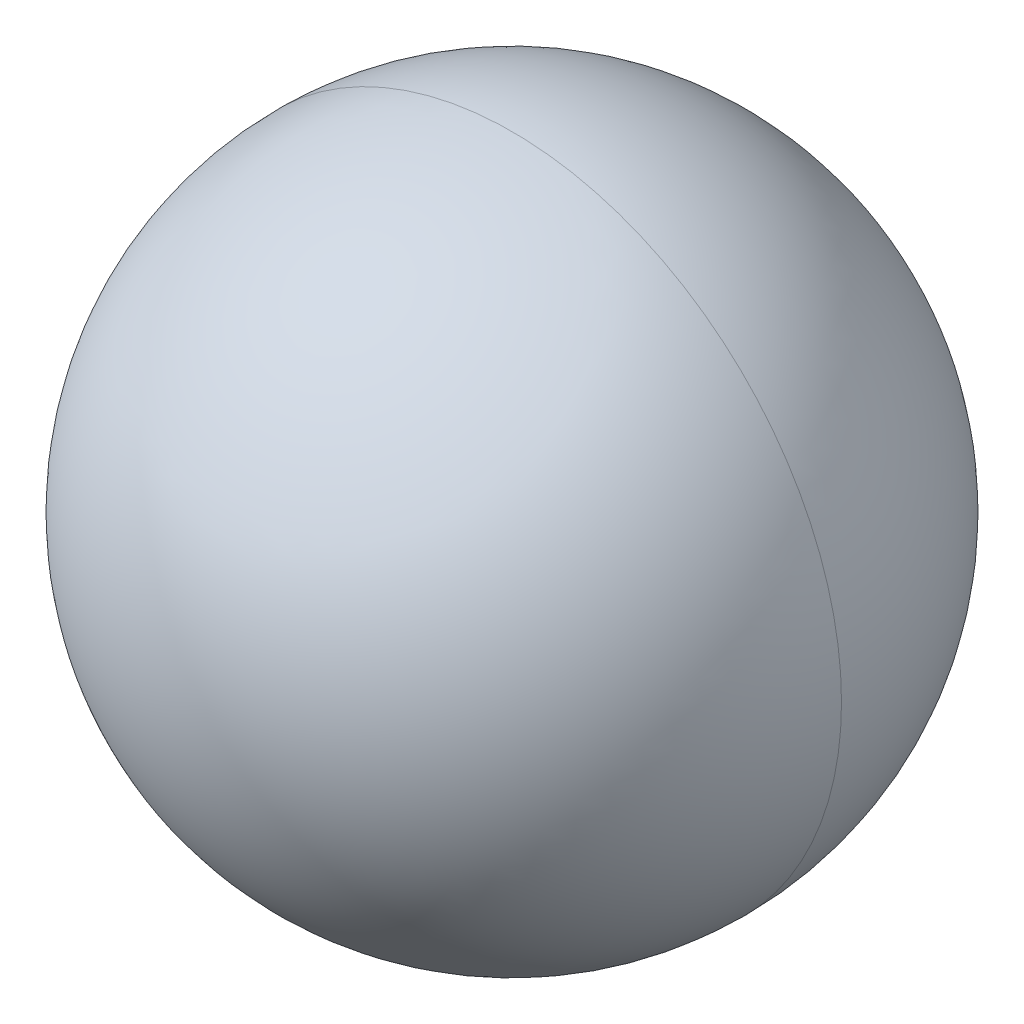
ISO-10303-21;
HEADER;
FILE_DESCRIPTION(('STEP AP214'),'2;1');
FILE_NAME('part.step','',(''),(''),'','','');
FILE_SCHEMA(('AUTOMOTIVE_DESIGN { 1 0 10303 214 1 1 1 1 }'));
ENDSEC;
DATA;
#1=APPLICATION_CONTEXT('core data for automotive mechanical design processes');
#2=APPLICATION_PROTOCOL_DEFINITION('international standard','automotive_design',2000,#1);
#3=PRODUCT_CONTEXT('',#1,'mechanical');
#4=PRODUCT('Part','Part','',(#3));
#5=PRODUCT_RELATED_PRODUCT_CATEGORY('part','',(#4));
#6=PRODUCT_DEFINITION_FORMATION('','',#4);
#7=PRODUCT_DEFINITION_CONTEXT('part definition',#1,'design');
#8=PRODUCT_DEFINITION('design','',#6,#7);
#9=PRODUCT_DEFINITION_SHAPE('','',#8);
#10=(LENGTH_UNIT() NAMED_UNIT(*) SI_UNIT(.MILLI.,.METRE.));
#11=(NAMED_UNIT(*) PLANE_ANGLE_UNIT() SI_UNIT($,.RADIAN.));
#12=(NAMED_UNIT(*) SI_UNIT($,.STERADIAN.) SOLID_ANGLE_UNIT());
#13=UNCERTAINTY_MEASURE_WITH_UNIT(LENGTH_MEASURE(1.E-05),#10,'distance_accuracy_value','');
#14=(GEOMETRIC_REPRESENTATION_CONTEXT(3) GLOBAL_UNCERTAINTY_ASSIGNED_CONTEXT((#13)) GLOBAL_UNIT_ASSIGNED_CONTEXT((#10,
#11,#12)) REPRESENTATION_CONTEXT('',''));
#15=CARTESIAN_POINT('',(0.,0.,0.));
#16=DIRECTION('',(0.,0.,1.));
#17=DIRECTION('',(1.,0.,0.));
#18=AXIS2_PLACEMENT_3D('',#15,#16,#17);
#19=CARTESIAN_POINT('',(0.,0.,0.));
#20=DIRECTION('',(0.,0.,-1.));
#21=DIRECTION('',(0.,-1.,0.));
#22=AXIS2_PLACEMENT_3D('',#19,#20,#21);
#23=SPHERICAL_SURFACE('',#22,0.9);
#24=CARTESIAN_POINT('',(0.,0.,0.));
#25=DIRECTION('',(0.,0.,-1.));
#26=DIRECTION('',(0.,1.,0.));
#27=AXIS2_PLACEMENT_3D('',#24,#25,#26);
#28=CIRCLE('',#27,0.9);
#29=CARTESIAN_POINT('',(-0.9,0.,0.));
#30=VERTEX_POINT('',#29);
#31=CARTESIAN_POINT('',(0.9,0.,0.));
#32=VERTEX_POINT('',#31);
#33=EDGE_CURVE('E11',#30,#32,#28,.T.);
#34=ORIENTED_EDGE('',*,*,#33,.F.);
#35=CARTESIAN_POINT('',(0.,0.,0.));
#36=DIRECTION('',(0.,0.,1.));
#37=DIRECTION('',(1.,0.,0.));
#38=AXIS2_PLACEMENT_3D('',#35,#36,#37);
#39=CIRCLE('',#38,0.9);
#40=EDGE_CURVE('E25',#30,#32,#39,.T.);
#41=ORIENTED_EDGE('',*,*,#40,.T.);
#42=EDGE_LOOP('',(#34,#41));
#43=FACE_BOUND('',#42,.T.);
#44=ADVANCED_FACE('F17',(#43),#23,.T.);
#45=CARTESIAN_POINT('',(0.,0.,0.));
#46=DIRECTION('',(0.,0.,-1.));
#47=DIRECTION('',(0.,-1.,0.));
#48=AXIS2_PLACEMENT_3D('',#45,#46,#47);
#49=SPHERICAL_SURFACE('',#48,0.9);
#50=ORIENTED_EDGE('',*,*,#40,.F.);
#51=ORIENTED_EDGE('',*,*,#33,.T.);
#52=EDGE_LOOP('',(#50,#51));
#53=FACE_BOUND('',#52,.T.);
#54=ADVANCED_FACE('F41',(#53),#49,.T.);
#55=CLOSED_SHELL('',(#44,#54));
#56=MANIFOLD_SOLID_BREP('B1',#55);
#57=ADVANCED_BREP_SHAPE_REPRESENTATION('',(#18,#56),#14);
#58=SHAPE_DEFINITION_REPRESENTATION(#9,#57);
ENDSEC;
END-ISO-10303-21;
